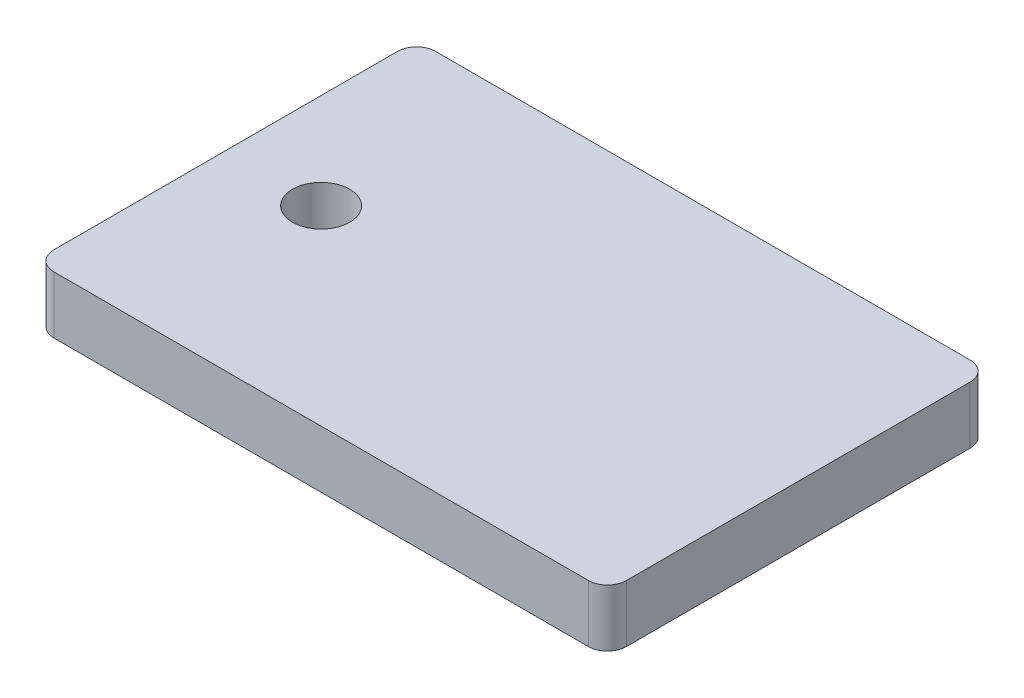
ISO-10303-21;
HEADER;
FILE_DESCRIPTION(('STEP AP214'),'2;1');
FILE_NAME('part.step','',(''),(''),'','','');
FILE_SCHEMA(('AUTOMOTIVE_DESIGN { 1 0 10303 214 1 1 1 1 }'));
ENDSEC;
DATA;
#1=APPLICATION_CONTEXT('core data for automotive mechanical design processes');
#2=APPLICATION_PROTOCOL_DEFINITION('international standard','automotive_design',2000,#1);
#3=PRODUCT_CONTEXT('',#1,'mechanical');
#4=PRODUCT('Part','Part','',(#3));
#5=PRODUCT_RELATED_PRODUCT_CATEGORY('part','',(#4));
#6=PRODUCT_DEFINITION_FORMATION('','',#4);
#7=PRODUCT_DEFINITION_CONTEXT('part definition',#1,'design');
#8=PRODUCT_DEFINITION('design','',#6,#7);
#9=PRODUCT_DEFINITION_SHAPE('','',#8);
#10=(LENGTH_UNIT() NAMED_UNIT(*) SI_UNIT(.MILLI.,.METRE.));
#11=(NAMED_UNIT(*) PLANE_ANGLE_UNIT() SI_UNIT($,.RADIAN.));
#12=(NAMED_UNIT(*) SI_UNIT($,.STERADIAN.) SOLID_ANGLE_UNIT());
#13=UNCERTAINTY_MEASURE_WITH_UNIT(LENGTH_MEASURE(1.E-05),#10,'distance_accuracy_value','');
#14=(GEOMETRIC_REPRESENTATION_CONTEXT(3) GLOBAL_UNCERTAINTY_ASSIGNED_CONTEXT((#13)) GLOBAL_UNIT_ASSIGNED_CONTEXT((#10,
#11,#12)) REPRESENTATION_CONTEXT('',''));
#15=CARTESIAN_POINT('',(0.,0.,0.));
#16=DIRECTION('',(0.,0.,1.));
#17=DIRECTION('',(1.,0.,0.));
#18=AXIS2_PLACEMENT_3D('',#15,#16,#17);
#19=CARTESIAN_POINT('',(0.,3.,0.));
#20=DIRECTION('',(0.,-1.,0.));
#21=DIRECTION('',(0.,0.,-1.));
#22=AXIS2_PLACEMENT_3D('',#19,#20,#21);
#23=PLANE('',#22);
#24=DIRECTION('',(-1.,0.,0.));
#25=VECTOR('',#24,1.);
#26=CARTESIAN_POINT('',(0.,3.,-20.));
#27=LINE('',#26,#25);
#28=CARTESIAN_POINT('',(29.,3.,-20.));
#29=VERTEX_POINT('',#28);
#30=CARTESIAN_POINT('',(1.,3.,-20.));
#31=VERTEX_POINT('',#30);
#32=EDGE_CURVE('E150',#29,#31,#27,.T.);
#33=ORIENTED_EDGE('',*,*,#32,.T.);
#34=CARTESIAN_POINT('',(1.,3.,-19.));
#35=DIRECTION('',(0.,-1.,0.));
#36=DIRECTION('',(0.,0.,-1.));
#37=AXIS2_PLACEMENT_3D('',#34,#35,#36);
#38=CIRCLE('',#37,1.);
#39=CARTESIAN_POINT('',(0.,3.,-19.));
#40=VERTEX_POINT('',#39);
#41=EDGE_CURVE('E179',#31,#40,#38,.F.);
#42=ORIENTED_EDGE('',*,*,#41,.T.);
#43=DIRECTION('',(0.,0.,1.));
#44=VECTOR('',#43,1.);
#45=CARTESIAN_POINT('',(0.,3.,0.));
#46=LINE('',#45,#44);
#47=CARTESIAN_POINT('',(0.,3.,-1.));
#48=VERTEX_POINT('',#47);
#49=EDGE_CURVE('E128',#40,#48,#46,.T.);
#50=ORIENTED_EDGE('',*,*,#49,.T.);
#51=CARTESIAN_POINT('',(1.,3.,-1.));
#52=DIRECTION('',(0.,-1.,0.));
#53=DIRECTION('',(0.,0.,-1.));
#54=AXIS2_PLACEMENT_3D('',#51,#52,#53);
#55=CIRCLE('',#54,1.);
#56=CARTESIAN_POINT('',(1.,3.,0.));
#57=VERTEX_POINT('',#56);
#58=EDGE_CURVE('E173',#48,#57,#55,.F.);
#59=ORIENTED_EDGE('',*,*,#58,.T.);
#60=DIRECTION('',(1.,0.,0.));
#61=VECTOR('',#60,1.);
#62=CARTESIAN_POINT('',(0.,3.,0.));
#63=LINE('',#62,#61);
#64=CARTESIAN_POINT('',(29.,3.,0.));
#65=VERTEX_POINT('',#64);
#66=EDGE_CURVE('E192',#57,#65,#63,.T.);
#67=ORIENTED_EDGE('',*,*,#66,.T.);
#68=CARTESIAN_POINT('',(29.,3.,-1.));
#69=DIRECTION('',(0.,-1.,0.));
#70=DIRECTION('',(0.,0.,-1.));
#71=AXIS2_PLACEMENT_3D('',#68,#69,#70);
#72=CIRCLE('',#71,1.);
#73=CARTESIAN_POINT('',(30.,3.,-1.));
#74=VERTEX_POINT('',#73);
#75=EDGE_CURVE('E62',#65,#74,#72,.F.);
#76=ORIENTED_EDGE('',*,*,#75,.T.);
#77=DIRECTION('',(0.,0.,-1.));
#78=VECTOR('',#77,1.);
#79=CARTESIAN_POINT('',(30.,3.,0.));
#80=LINE('',#79,#78);
#81=CARTESIAN_POINT('',(30.,3.,-19.));
#82=VERTEX_POINT('',#81);
#83=EDGE_CURVE('E199',#74,#82,#80,.T.);
#84=ORIENTED_EDGE('',*,*,#83,.T.);
#85=CARTESIAN_POINT('',(29.,3.,-19.));
#86=DIRECTION('',(0.,-1.,0.));
#87=DIRECTION('',(0.,0.,-1.));
#88=AXIS2_PLACEMENT_3D('',#85,#86,#87);
#89=CIRCLE('',#88,1.);
#90=EDGE_CURVE('E176',#82,#29,#89,.F.);
#91=ORIENTED_EDGE('',*,*,#90,.T.);
#92=EDGE_LOOP('',(#33,#42,#50,#59,#67,#76,#84,#91));
#93=FACE_BOUND('',#92,.T.);
#94=CARTESIAN_POINT('',(5.,3.,-10.));
#95=DIRECTION('',(0.,1.,0.));
#96=DIRECTION('',(0.,0.,1.));
#97=AXIS2_PLACEMENT_3D('',#94,#95,#96);
#98=CIRCLE('',#97,1.5);
#99=CARTESIAN_POINT('',(5.,3.,-8.5));
#100=VERTEX_POINT('',#99);
#101=EDGE_CURVE('E139',#100,#100,#98,.T.);
#102=ORIENTED_EDGE('',*,*,#101,.F.);
#103=EDGE_LOOP('',(#102));
#104=FACE_BOUND('',#103,.T.);
#105=ADVANCED_FACE('F39',(#93,#104),#23,.F.);
#106=CARTESIAN_POINT('',(0.,0.,0.));
#107=DIRECTION('',(0.,-1.,0.));
#108=DIRECTION('',(0.,0.,-1.));
#109=AXIS2_PLACEMENT_3D('',#106,#107,#108);
#110=PLANE('',#109);
#111=DIRECTION('',(0.,0.,1.));
#112=VECTOR('',#111,1.);
#113=CARTESIAN_POINT('',(0.,0.,0.));
#114=LINE('',#113,#112);
#115=CARTESIAN_POINT('',(0.,0.,-19.));
#116=VERTEX_POINT('',#115);
#117=CARTESIAN_POINT('',(0.,0.,-1.));
#118=VERTEX_POINT('',#117);
#119=EDGE_CURVE('E125',#116,#118,#114,.T.);
#120=ORIENTED_EDGE('',*,*,#119,.F.);
#121=CARTESIAN_POINT('',(1.,0.,-19.));
#122=DIRECTION('',(0.,-1.,0.));
#123=DIRECTION('',(0.,0.,-1.));
#124=AXIS2_PLACEMENT_3D('',#121,#122,#123);
#125=CIRCLE('',#124,1.);
#126=CARTESIAN_POINT('',(1.,0.,-20.));
#127=VERTEX_POINT('',#126);
#128=EDGE_CURVE('E107',#116,#127,#125,.T.);
#129=ORIENTED_EDGE('',*,*,#128,.T.);
#130=DIRECTION('',(-1.,0.,0.));
#131=VECTOR('',#130,1.);
#132=CARTESIAN_POINT('',(0.,0.,-20.));
#133=LINE('',#132,#131);
#134=CARTESIAN_POINT('',(29.,0.,-20.));
#135=VERTEX_POINT('',#134);
#136=EDGE_CURVE('E155',#135,#127,#133,.T.);
#137=ORIENTED_EDGE('',*,*,#136,.F.);
#138=CARTESIAN_POINT('',(29.,0.,-19.));
#139=DIRECTION('',(0.,-1.,0.));
#140=DIRECTION('',(0.,0.,-1.));
#141=AXIS2_PLACEMENT_3D('',#138,#139,#140);
#142=CIRCLE('',#141,1.);
#143=CARTESIAN_POINT('',(30.,0.,-19.));
#144=VERTEX_POINT('',#143);
#145=EDGE_CURVE('E119',#135,#144,#142,.T.);
#146=ORIENTED_EDGE('',*,*,#145,.T.);
#147=DIRECTION('',(0.,0.,-1.));
#148=VECTOR('',#147,1.);
#149=CARTESIAN_POINT('',(30.,0.,0.));
#150=LINE('',#149,#148);
#151=CARTESIAN_POINT('',(30.,0.,-1.));
#152=VERTEX_POINT('',#151);
#153=EDGE_CURVE('E144',#152,#144,#150,.T.);
#154=ORIENTED_EDGE('',*,*,#153,.F.);
#155=CARTESIAN_POINT('',(29.,0.,-1.));
#156=DIRECTION('',(0.,-1.,0.));
#157=DIRECTION('',(0.,0.,-1.));
#158=AXIS2_PLACEMENT_3D('',#155,#156,#157);
#159=CIRCLE('',#158,1.);
#160=CARTESIAN_POINT('',(29.,0.,0.));
#161=VERTEX_POINT('',#160);
#162=EDGE_CURVE('E130',#152,#161,#159,.T.);
#163=ORIENTED_EDGE('',*,*,#162,.T.);
#164=DIRECTION('',(1.,0.,0.));
#165=VECTOR('',#164,1.);
#166=CARTESIAN_POINT('',(0.,0.,0.));
#167=LINE('',#166,#165);
#168=CARTESIAN_POINT('',(1.,0.,0.));
#169=VERTEX_POINT('',#168);
#170=EDGE_CURVE('E138',#169,#161,#167,.T.);
#171=ORIENTED_EDGE('',*,*,#170,.F.);
#172=CARTESIAN_POINT('',(1.,0.,-1.));
#173=DIRECTION('',(0.,-1.,0.));
#174=DIRECTION('',(0.,0.,-1.));
#175=AXIS2_PLACEMENT_3D('',#172,#173,#174);
#176=CIRCLE('',#175,1.);
#177=EDGE_CURVE('E136',#169,#118,#176,.T.);
#178=ORIENTED_EDGE('',*,*,#177,.T.);
#179=EDGE_LOOP('',(#120,#129,#137,#146,#154,#163,#171,#178));
#180=FACE_BOUND('',#179,.T.);
#181=CARTESIAN_POINT('',(5.,0.,-10.));
#182=DIRECTION('',(0.,1.,0.));
#183=DIRECTION('',(0.,0.,1.));
#184=AXIS2_PLACEMENT_3D('',#181,#182,#183);
#185=CIRCLE('',#184,1.5);
#186=CARTESIAN_POINT('',(5.,0.,-8.5));
#187=VERTEX_POINT('',#186);
#188=EDGE_CURVE('E147',#187,#187,#185,.T.);
#189=ORIENTED_EDGE('',*,*,#188,.T.);
#190=EDGE_LOOP('',(#189));
#191=FACE_BOUND('',#190,.T.);
#192=ADVANCED_FACE('F133',(#180,#191),#110,.T.);
#193=CARTESIAN_POINT('',(0.,3.,0.));
#194=DIRECTION('',(1.,0.,0.));
#195=DIRECTION('',(0.,0.,-1.));
#196=AXIS2_PLACEMENT_3D('',#193,#194,#195);
#197=PLANE('',#196);
#198=ORIENTED_EDGE('',*,*,#49,.F.);
#199=DIRECTION('',(0.,-1.,0.));
#200=VECTOR('',#199,1.);
#201=CARTESIAN_POINT('',(0.,3.,-19.));
#202=LINE('',#201,#200);
#203=EDGE_CURVE('E111',#40,#116,#202,.T.);
#204=ORIENTED_EDGE('',*,*,#203,.T.);
#205=ORIENTED_EDGE('',*,*,#119,.T.);
#206=DIRECTION('',(0.,-1.,0.));
#207=VECTOR('',#206,1.);
#208=CARTESIAN_POINT('',(0.,3.,-1.));
#209=LINE('',#208,#207);
#210=EDGE_CURVE('E131',#118,#48,#209,.F.);
#211=ORIENTED_EDGE('',*,*,#210,.T.);
#212=EDGE_LOOP('',(#198,#204,#205,#211));
#213=FACE_BOUND('',#212,.T.);
#214=ADVANCED_FACE('F124',(#213),#197,.F.);
#215=CARTESIAN_POINT('',(0.,3.,0.));
#216=DIRECTION('',(0.,0.,-1.));
#217=DIRECTION('',(-1.,0.,0.));
#218=AXIS2_PLACEMENT_3D('',#215,#216,#217);
#219=PLANE('',#218);
#220=ORIENTED_EDGE('',*,*,#66,.F.);
#221=DIRECTION('',(0.,-1.,0.));
#222=VECTOR('',#221,1.);
#223=CARTESIAN_POINT('',(1.,3.,0.));
#224=LINE('',#223,#222);
#225=EDGE_CURVE('E11',#57,#169,#224,.T.);
#226=ORIENTED_EDGE('',*,*,#225,.T.);
#227=ORIENTED_EDGE('',*,*,#170,.T.);
#228=DIRECTION('',(0.,-1.,0.));
#229=VECTOR('',#228,1.);
#230=CARTESIAN_POINT('',(29.,3.,0.));
#231=LINE('',#230,#229);
#232=EDGE_CURVE('E48',#161,#65,#231,.F.);
#233=ORIENTED_EDGE('',*,*,#232,.T.);
#234=EDGE_LOOP('',(#220,#226,#227,#233));
#235=FACE_BOUND('',#234,.T.);
#236=ADVANCED_FACE('F191',(#235),#219,.F.);
#237=CARTESIAN_POINT('',(30.,3.,0.));
#238=DIRECTION('',(-1.,0.,0.));
#239=DIRECTION('',(0.,0.,1.));
#240=AXIS2_PLACEMENT_3D('',#237,#238,#239);
#241=PLANE('',#240);
#242=ORIENTED_EDGE('',*,*,#153,.T.);
#243=DIRECTION('',(0.,-1.,0.));
#244=VECTOR('',#243,1.);
#245=CARTESIAN_POINT('',(30.,3.,-19.));
#246=LINE('',#245,#244);
#247=EDGE_CURVE('E55',#144,#82,#246,.F.);
#248=ORIENTED_EDGE('',*,*,#247,.T.);
#249=ORIENTED_EDGE('',*,*,#83,.F.);
#250=DIRECTION('',(0.,-1.,0.));
#251=VECTOR('',#250,1.);
#252=CARTESIAN_POINT('',(30.,3.,-1.));
#253=LINE('',#252,#251);
#254=EDGE_CURVE('E182',#74,#152,#253,.T.);
#255=ORIENTED_EDGE('',*,*,#254,.T.);
#256=EDGE_LOOP('',(#242,#248,#249,#255));
#257=FACE_BOUND('',#256,.T.);
#258=ADVANCED_FACE('F203',(#257),#241,.F.);
#259=CARTESIAN_POINT('',(0.,3.,-20.));
#260=DIRECTION('',(0.,0.,1.));
#261=DIRECTION('',(1.,0.,0.));
#262=AXIS2_PLACEMENT_3D('',#259,#260,#261);
#263=PLANE('',#262);
#264=ORIENTED_EDGE('',*,*,#136,.T.);
#265=DIRECTION('',(0.,-1.,0.));
#266=VECTOR('',#265,1.);
#267=CARTESIAN_POINT('',(1.,3.,-20.));
#268=LINE('',#267,#266);
#269=EDGE_CURVE('E112',#127,#31,#268,.F.);
#270=ORIENTED_EDGE('',*,*,#269,.T.);
#271=ORIENTED_EDGE('',*,*,#32,.F.);
#272=DIRECTION('',(0.,-1.,0.));
#273=VECTOR('',#272,1.);
#274=CARTESIAN_POINT('',(29.,3.,-20.));
#275=LINE('',#274,#273);
#276=EDGE_CURVE('E118',#29,#135,#275,.T.);
#277=ORIENTED_EDGE('',*,*,#276,.T.);
#278=EDGE_LOOP('',(#264,#270,#271,#277));
#279=FACE_BOUND('',#278,.T.);
#280=ADVANCED_FACE('F210',(#279),#263,.F.);
#281=CARTESIAN_POINT('',(5.,3.,-10.));
#282=DIRECTION('',(0.,-1.,0.));
#283=DIRECTION('',(0.,0.,-1.));
#284=AXIS2_PLACEMENT_3D('',#281,#282,#283);
#285=CYLINDRICAL_SURFACE('',#284,1.5);
#286=ORIENTED_EDGE('',*,*,#101,.T.);
#287=EDGE_LOOP('',(#286));
#288=FACE_BOUND('',#287,.T.);
#289=ORIENTED_EDGE('',*,*,#188,.F.);
#290=EDGE_LOOP('',(#289));
#291=FACE_BOUND('',#290,.T.);
#292=ADVANCED_FACE('F220',(#288,#291),#285,.F.);
#293=CARTESIAN_POINT('',(1.,3.,-19.));
#294=DIRECTION('',(0.,-1.,0.));
#295=DIRECTION('',(0.,0.,-1.));
#296=AXIS2_PLACEMENT_3D('',#293,#294,#295);
#297=CYLINDRICAL_SURFACE('',#296,1.);
#298=ORIENTED_EDGE('',*,*,#41,.F.);
#299=ORIENTED_EDGE('',*,*,#269,.F.);
#300=ORIENTED_EDGE('',*,*,#128,.F.);
#301=ORIENTED_EDGE('',*,*,#203,.F.);
#302=EDGE_LOOP('',(#298,#299,#300,#301));
#303=FACE_BOUND('',#302,.T.);
#304=ADVANCED_FACE('F110',(#303),#297,.T.);
#305=CARTESIAN_POINT('',(29.,3.,-19.));
#306=DIRECTION('',(0.,-1.,0.));
#307=DIRECTION('',(0.,0.,-1.));
#308=AXIS2_PLACEMENT_3D('',#305,#306,#307);
#309=CYLINDRICAL_SURFACE('',#308,1.);
#310=ORIENTED_EDGE('',*,*,#90,.F.);
#311=ORIENTED_EDGE('',*,*,#247,.F.);
#312=ORIENTED_EDGE('',*,*,#145,.F.);
#313=ORIENTED_EDGE('',*,*,#276,.F.);
#314=EDGE_LOOP('',(#310,#311,#312,#313));
#315=FACE_BOUND('',#314,.T.);
#316=ADVANCED_FACE('F207',(#315),#309,.T.);
#317=CARTESIAN_POINT('',(1.,3.,-1.));
#318=DIRECTION('',(0.,-1.,0.));
#319=DIRECTION('',(0.,0.,-1.));
#320=AXIS2_PLACEMENT_3D('',#317,#318,#319);
#321=CYLINDRICAL_SURFACE('',#320,1.);
#322=ORIENTED_EDGE('',*,*,#58,.F.);
#323=ORIENTED_EDGE('',*,*,#210,.F.);
#324=ORIENTED_EDGE('',*,*,#177,.F.);
#325=ORIENTED_EDGE('',*,*,#225,.F.);
#326=EDGE_LOOP('',(#322,#323,#324,#325));
#327=FACE_BOUND('',#326,.T.);
#328=ADVANCED_FACE('F244',(#327),#321,.T.);
#329=CARTESIAN_POINT('',(29.,3.,-1.));
#330=DIRECTION('',(0.,-1.,0.));
#331=DIRECTION('',(0.,0.,-1.));
#332=AXIS2_PLACEMENT_3D('',#329,#330,#331);
#333=CYLINDRICAL_SURFACE('',#332,1.);
#334=ORIENTED_EDGE('',*,*,#75,.F.);
#335=ORIENTED_EDGE('',*,*,#232,.F.);
#336=ORIENTED_EDGE('',*,*,#162,.F.);
#337=ORIENTED_EDGE('',*,*,#254,.F.);
#338=EDGE_LOOP('',(#334,#335,#336,#337));
#339=FACE_BOUND('',#338,.T.);
#340=ADVANCED_FACE('F41',(#339),#333,.T.);
#341=CLOSED_SHELL('',(#105,#192,#214,#236,#258,#280,#292,#304,#316,#328,#340));
#342=MANIFOLD_SOLID_BREP('B2',#341);
#343=ADVANCED_BREP_SHAPE_REPRESENTATION('',(#18,#342),#14);
#344=SHAPE_DEFINITION_REPRESENTATION(#9,#343);
ENDSEC;
END-ISO-10303-21;
